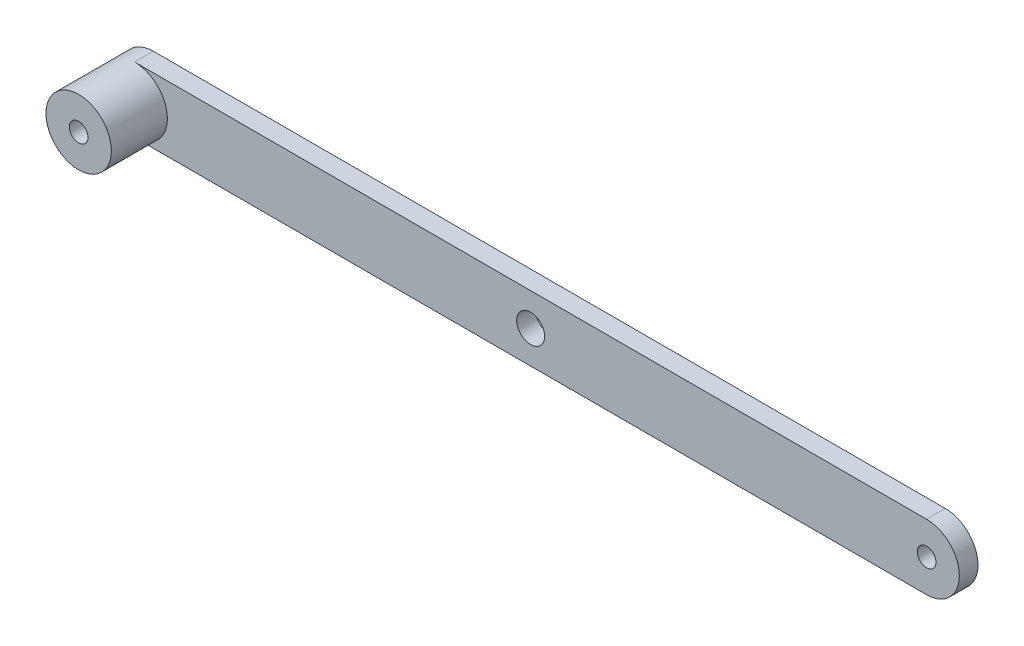
ISO-10303-21;
HEADER;
FILE_DESCRIPTION(('STEP AP214'),'2;1');
FILE_NAME('part.step','',(''),(''),'','','');
FILE_SCHEMA(('AUTOMOTIVE_DESIGN { 1 0 10303 214 1 1 1 1 }'));
ENDSEC;
DATA;
#1=APPLICATION_CONTEXT('core data for automotive mechanical design processes');
#2=APPLICATION_PROTOCOL_DEFINITION('international standard','automotive_design',2000,#1);
#3=PRODUCT_CONTEXT('',#1,'mechanical');
#4=PRODUCT('Part','Part','',(#3));
#5=PRODUCT_RELATED_PRODUCT_CATEGORY('part','',(#4));
#6=PRODUCT_DEFINITION_FORMATION('','',#4);
#7=PRODUCT_DEFINITION_CONTEXT('part definition',#1,'design');
#8=PRODUCT_DEFINITION('design','',#6,#7);
#9=PRODUCT_DEFINITION_SHAPE('','',#8);
#10=(LENGTH_UNIT() NAMED_UNIT(*) SI_UNIT(.MILLI.,.METRE.));
#11=(NAMED_UNIT(*) PLANE_ANGLE_UNIT() SI_UNIT($,.RADIAN.));
#12=(NAMED_UNIT(*) SI_UNIT($,.STERADIAN.) SOLID_ANGLE_UNIT());
#13=UNCERTAINTY_MEASURE_WITH_UNIT(LENGTH_MEASURE(1.E-05),#10,'distance_accuracy_value','');
#14=(GEOMETRIC_REPRESENTATION_CONTEXT(3) GLOBAL_UNCERTAINTY_ASSIGNED_CONTEXT((#13)) GLOBAL_UNIT_ASSIGNED_CONTEXT((#10,
#11,#12)) REPRESENTATION_CONTEXT('',''));
#15=CARTESIAN_POINT('',(0.,0.,0.));
#16=DIRECTION('',(0.,0.,1.));
#17=DIRECTION('',(1.,0.,0.));
#18=AXIS2_PLACEMENT_3D('',#15,#16,#17);
#19=CARTESIAN_POINT('',(-212.,0.,10.));
#20=DIRECTION('',(0.,0.,1.));
#21=DIRECTION('',(1.,0.,0.));
#22=AXIS2_PLACEMENT_3D('',#19,#20,#21);
#23=PLANE('',#22);
#24=CARTESIAN_POINT('',(-212.,0.,10.));
#25=DIRECTION('',(0.,0.,1.));
#26=DIRECTION('',(1.,0.,0.));
#27=AXIS2_PLACEMENT_3D('',#24,#25,#26);
#28=CIRCLE('',#27,17.5);
#29=CARTESIAN_POINT('',(-212.,-17.5,10.));
#30=VERTEX_POINT('',#29);
#31=CARTESIAN_POINT('',(-212.,17.5,10.));
#32=VERTEX_POINT('',#31);
#33=EDGE_CURVE('E11',#30,#32,#28,.T.);
#34=ORIENTED_EDGE('',*,*,#33,.F.);
#35=DIRECTION('',(1.,0.,0.));
#36=VECTOR('',#35,1.);
#37=CARTESIAN_POINT('',(-212.,-17.5,10.));
#38=LINE('',#37,#36);
#39=CARTESIAN_POINT('',(212.,-17.5,10.));
#40=VERTEX_POINT('',#39);
#41=EDGE_CURVE('E113',#30,#40,#38,.T.);
#42=ORIENTED_EDGE('',*,*,#41,.T.);
#43=CARTESIAN_POINT('',(212.,0.,10.));
#44=DIRECTION('',(0.,0.,1.));
#45=DIRECTION('',(1.,0.,0.));
#46=AXIS2_PLACEMENT_3D('',#43,#44,#45);
#47=CIRCLE('',#46,17.5);
#48=CARTESIAN_POINT('',(212.,17.5,10.));
#49=VERTEX_POINT('',#48);
#50=EDGE_CURVE('E58',#40,#49,#47,.T.);
#51=ORIENTED_EDGE('',*,*,#50,.T.);
#52=DIRECTION('',(-1.,0.,0.));
#53=VECTOR('',#52,1.);
#54=CARTESIAN_POINT('',(-212.,17.5,10.));
#55=LINE('',#54,#53);
#56=EDGE_CURVE('E89',#49,#32,#55,.T.);
#57=ORIENTED_EDGE('',*,*,#56,.T.);
#58=EDGE_LOOP('',(#34,#42,#51,#57));
#59=FACE_BOUND('',#58,.T.);
#60=CARTESIAN_POINT('',(212.,0.,10.));
#61=DIRECTION('',(0.,0.,1.));
#62=DIRECTION('',(1.,0.,0.));
#63=AXIS2_PLACEMENT_3D('',#60,#61,#62);
#64=CIRCLE('',#63,5.00000000000002);
#65=CARTESIAN_POINT('',(217.,0.,10.));
#66=VERTEX_POINT('',#65);
#67=EDGE_CURVE('E129',#66,#66,#64,.T.);
#68=ORIENTED_EDGE('',*,*,#67,.F.);
#69=EDGE_LOOP('',(#68));
#70=FACE_BOUND('',#69,.T.);
#71=CARTESIAN_POINT('',(0.,0.,10.));
#72=DIRECTION('',(0.,0.,1.));
#73=DIRECTION('',(1.,0.,0.));
#74=AXIS2_PLACEMENT_3D('',#71,#72,#73);
#75=CIRCLE('',#74,7.5);
#76=CARTESIAN_POINT('',(7.5,0.,10.));
#77=VERTEX_POINT('',#76);
#78=EDGE_CURVE('E134',#77,#77,#75,.T.);
#79=ORIENTED_EDGE('',*,*,#78,.F.);
#80=EDGE_LOOP('',(#79));
#81=FACE_BOUND('',#80,.T.);
#82=ADVANCED_FACE('F39',(#59,#70,#81),#23,.T.);
#83=CARTESIAN_POINT('',(-212.,0.,0.));
#84=DIRECTION('',(0.,0.,1.));
#85=DIRECTION('',(1.,0.,0.));
#86=AXIS2_PLACEMENT_3D('',#83,#84,#85);
#87=PLANE('',#86);
#88=CARTESIAN_POINT('',(-212.,0.,0.));
#89=DIRECTION('',(0.,0.,1.));
#90=DIRECTION('',(1.,0.,0.));
#91=AXIS2_PLACEMENT_3D('',#88,#89,#90);
#92=CIRCLE('',#91,17.5);
#93=CARTESIAN_POINT('',(-212.,17.5,0.));
#94=VERTEX_POINT('',#93);
#95=CARTESIAN_POINT('',(-212.,-17.5,0.));
#96=VERTEX_POINT('',#95);
#97=EDGE_CURVE('E102',#94,#96,#92,.T.);
#98=ORIENTED_EDGE('',*,*,#97,.F.);
#99=DIRECTION('',(-1.,0.,0.));
#100=VECTOR('',#99,1.);
#101=CARTESIAN_POINT('',(-212.,17.5,0.));
#102=LINE('',#101,#100);
#103=CARTESIAN_POINT('',(212.,17.5,0.));
#104=VERTEX_POINT('',#103);
#105=EDGE_CURVE('E81',#104,#94,#102,.T.);
#106=ORIENTED_EDGE('',*,*,#105,.F.);
#107=CARTESIAN_POINT('',(212.,0.,0.));
#108=DIRECTION('',(0.,0.,1.));
#109=DIRECTION('',(1.,0.,0.));
#110=AXIS2_PLACEMENT_3D('',#107,#108,#109);
#111=CIRCLE('',#110,17.5);
#112=CARTESIAN_POINT('',(212.,-17.5,0.));
#113=VERTEX_POINT('',#112);
#114=EDGE_CURVE('E75',#113,#104,#111,.T.);
#115=ORIENTED_EDGE('',*,*,#114,.F.);
#116=DIRECTION('',(1.,0.,0.));
#117=VECTOR('',#116,1.);
#118=CARTESIAN_POINT('',(-212.,-17.5,0.));
#119=LINE('',#118,#117);
#120=EDGE_CURVE('E116',#96,#113,#119,.T.);
#121=ORIENTED_EDGE('',*,*,#120,.F.);
#122=EDGE_LOOP('',(#98,#106,#115,#121));
#123=FACE_BOUND('',#122,.T.);
#124=CARTESIAN_POINT('',(-212.,0.,0.));
#125=DIRECTION('',(0.,0.,1.));
#126=DIRECTION('',(1.,0.,0.));
#127=AXIS2_PLACEMENT_3D('',#124,#125,#126);
#128=CIRCLE('',#127,5.00000000000002);
#129=CARTESIAN_POINT('',(-207.,0.,0.));
#130=VERTEX_POINT('',#129);
#131=EDGE_CURVE('E120',#130,#130,#128,.T.);
#132=ORIENTED_EDGE('',*,*,#131,.T.);
#133=EDGE_LOOP('',(#132));
#134=FACE_BOUND('',#133,.T.);
#135=CARTESIAN_POINT('',(212.,0.,0.));
#136=DIRECTION('',(0.,0.,1.));
#137=DIRECTION('',(1.,0.,0.));
#138=AXIS2_PLACEMENT_3D('',#135,#136,#137);
#139=CIRCLE('',#138,5.00000000000002);
#140=CARTESIAN_POINT('',(217.,0.,0.));
#141=VERTEX_POINT('',#140);
#142=EDGE_CURVE('E130',#141,#141,#139,.T.);
#143=ORIENTED_EDGE('',*,*,#142,.T.);
#144=EDGE_LOOP('',(#143));
#145=FACE_BOUND('',#144,.T.);
#146=CARTESIAN_POINT('',(0.,0.,0.));
#147=DIRECTION('',(0.,0.,1.));
#148=DIRECTION('',(1.,0.,0.));
#149=AXIS2_PLACEMENT_3D('',#146,#147,#148);
#150=CIRCLE('',#149,7.5);
#151=CARTESIAN_POINT('',(7.5,0.,0.));
#152=VERTEX_POINT('',#151);
#153=EDGE_CURVE('E138',#152,#152,#150,.T.);
#154=ORIENTED_EDGE('',*,*,#153,.T.);
#155=EDGE_LOOP('',(#154));
#156=FACE_BOUND('',#155,.T.);
#157=ADVANCED_FACE('F168',(#123,#134,#145,#156),#87,.F.);
#158=CARTESIAN_POINT('',(-212.,0.,10.));
#159=DIRECTION('',(0.,0.,-1.));
#160=DIRECTION('',(-1.,0.,0.));
#161=AXIS2_PLACEMENT_3D('',#158,#159,#160);
#162=CYLINDRICAL_SURFACE('',#161,17.5);
#163=ORIENTED_EDGE('',*,*,#97,.T.);
#164=DIRECTION('',(0.,0.,-1.));
#165=VECTOR('',#164,1.);
#166=CARTESIAN_POINT('',(-212.,-17.5,10.));
#167=LINE('',#166,#165);
#168=EDGE_CURVE('E43',#30,#96,#167,.T.);
#169=ORIENTED_EDGE('',*,*,#168,.F.);
#170=ORIENTED_EDGE('',*,*,#33,.T.);
#171=DIRECTION('',(0.,0.,-1.));
#172=VECTOR('',#171,1.);
#173=CARTESIAN_POINT('',(-212.,17.5,10.));
#174=LINE('',#173,#172);
#175=EDGE_CURVE('E87',#32,#94,#174,.T.);
#176=ORIENTED_EDGE('',*,*,#175,.T.);
#177=EDGE_LOOP('',(#163,#169,#170,#176));
#178=FACE_BOUND('',#177,.T.);
#179=CARTESIAN_POINT('',(-212.,0.,40.));
#180=DIRECTION('',(0.,0.,1.));
#181=DIRECTION('',(1.,0.,0.));
#182=AXIS2_PLACEMENT_3D('',#179,#180,#181);
#183=CIRCLE('',#182,17.5);
#184=CARTESIAN_POINT('',(-194.5,0.,40.));
#185=VERTEX_POINT('',#184);
#186=EDGE_CURVE('E142',#185,#185,#183,.T.);
#187=ORIENTED_EDGE('',*,*,#186,.F.);
#188=EDGE_LOOP('',(#187));
#189=FACE_BOUND('',#188,.T.);
#190=ADVANCED_FACE('F41',(#178,#189),#162,.T.);
#191=CARTESIAN_POINT('',(-212.,-17.5,10.));
#192=DIRECTION('',(0.,1.,0.));
#193=DIRECTION('',(0.,0.,1.));
#194=AXIS2_PLACEMENT_3D('',#191,#192,#193);
#195=PLANE('',#194);
#196=ORIENTED_EDGE('',*,*,#120,.T.);
#197=DIRECTION('',(0.,0.,-1.));
#198=VECTOR('',#197,1.);
#199=CARTESIAN_POINT('',(212.,-17.5,10.));
#200=LINE('',#199,#198);
#201=EDGE_CURVE('E105',#40,#113,#200,.T.);
#202=ORIENTED_EDGE('',*,*,#201,.F.);
#203=ORIENTED_EDGE('',*,*,#41,.F.);
#204=ORIENTED_EDGE('',*,*,#168,.T.);
#205=EDGE_LOOP('',(#196,#202,#203,#204));
#206=FACE_BOUND('',#205,.T.);
#207=ADVANCED_FACE('F182',(#206),#195,.F.);
#208=CARTESIAN_POINT('',(212.,0.,10.));
#209=DIRECTION('',(0.,0.,-1.));
#210=DIRECTION('',(-1.,0.,0.));
#211=AXIS2_PLACEMENT_3D('',#208,#209,#210);
#212=CYLINDRICAL_SURFACE('',#211,17.5);
#213=ORIENTED_EDGE('',*,*,#114,.T.);
#214=DIRECTION('',(0.,0.,-1.));
#215=VECTOR('',#214,1.);
#216=CARTESIAN_POINT('',(212.,17.5,10.));
#217=LINE('',#216,#215);
#218=EDGE_CURVE('E94',#49,#104,#217,.T.);
#219=ORIENTED_EDGE('',*,*,#218,.F.);
#220=ORIENTED_EDGE('',*,*,#50,.F.);
#221=ORIENTED_EDGE('',*,*,#201,.T.);
#222=EDGE_LOOP('',(#213,#219,#220,#221));
#223=FACE_BOUND('',#222,.T.);
#224=ADVANCED_FACE('F180',(#223),#212,.T.);
#225=CARTESIAN_POINT('',(-212.,17.5,10.));
#226=DIRECTION('',(0.,-1.,0.));
#227=DIRECTION('',(0.,0.,-1.));
#228=AXIS2_PLACEMENT_3D('',#225,#226,#227);
#229=PLANE('',#228);
#230=ORIENTED_EDGE('',*,*,#105,.T.);
#231=ORIENTED_EDGE('',*,*,#175,.F.);
#232=ORIENTED_EDGE('',*,*,#56,.F.);
#233=ORIENTED_EDGE('',*,*,#218,.T.);
#234=EDGE_LOOP('',(#230,#231,#232,#233));
#235=FACE_BOUND('',#234,.T.);
#236=ADVANCED_FACE('F88',(#235),#229,.F.);
#237=CARTESIAN_POINT('',(-212.,0.,10.));
#238=DIRECTION('',(0.,0.,-1.));
#239=DIRECTION('',(-1.,0.,0.));
#240=AXIS2_PLACEMENT_3D('',#237,#238,#239);
#241=CYLINDRICAL_SURFACE('',#240,5.00000000000002);
#242=ORIENTED_EDGE('',*,*,#131,.F.);
#243=EDGE_LOOP('',(#242));
#244=FACE_BOUND('',#243,.T.);
#245=CARTESIAN_POINT('',(-212.,0.,40.));
#246=DIRECTION('',(0.,0.,1.));
#247=DIRECTION('',(1.,0.,0.));
#248=AXIS2_PLACEMENT_3D('',#245,#246,#247);
#249=CIRCLE('',#248,5.00000000000002);
#250=CARTESIAN_POINT('',(-207.,0.,40.));
#251=VERTEX_POINT('',#250);
#252=EDGE_CURVE('E149',#251,#251,#249,.T.);
#253=ORIENTED_EDGE('',*,*,#252,.T.);
#254=EDGE_LOOP('',(#253));
#255=FACE_BOUND('',#254,.T.);
#256=ADVANCED_FACE('F154',(#244,#255),#241,.F.);
#257=CARTESIAN_POINT('',(212.,0.,10.));
#258=DIRECTION('',(0.,0.,-1.));
#259=DIRECTION('',(-1.,0.,0.));
#260=AXIS2_PLACEMENT_3D('',#257,#258,#259);
#261=CYLINDRICAL_SURFACE('',#260,5.00000000000002);
#262=ORIENTED_EDGE('',*,*,#67,.T.);
#263=EDGE_LOOP('',(#262));
#264=FACE_BOUND('',#263,.T.);
#265=ORIENTED_EDGE('',*,*,#142,.F.);
#266=EDGE_LOOP('',(#265));
#267=FACE_BOUND('',#266,.T.);
#268=ADVANCED_FACE('F164',(#264,#267),#261,.F.);
#269=CARTESIAN_POINT('',(0.,0.,10.));
#270=DIRECTION('',(0.,0.,-1.));
#271=DIRECTION('',(-1.,0.,0.));
#272=AXIS2_PLACEMENT_3D('',#269,#270,#271);
#273=CYLINDRICAL_SURFACE('',#272,7.5);
#274=ORIENTED_EDGE('',*,*,#78,.T.);
#275=EDGE_LOOP('',(#274));
#276=FACE_BOUND('',#275,.T.);
#277=ORIENTED_EDGE('',*,*,#153,.F.);
#278=EDGE_LOOP('',(#277));
#279=FACE_BOUND('',#278,.T.);
#280=ADVANCED_FACE('F158',(#276,#279),#273,.F.);
#281=CARTESIAN_POINT('',(-212.,0.,40.));
#282=DIRECTION('',(0.,0.,1.));
#283=DIRECTION('',(1.,0.,0.));
#284=AXIS2_PLACEMENT_3D('',#281,#282,#283);
#285=PLANE('',#284);
#286=ORIENTED_EDGE('',*,*,#186,.T.);
#287=EDGE_LOOP('',(#286));
#288=FACE_BOUND('',#287,.T.);
#289=ORIENTED_EDGE('',*,*,#252,.F.);
#290=EDGE_LOOP('',(#289));
#291=FACE_BOUND('',#290,.T.);
#292=ADVANCED_FACE('F156',(#288,#291),#285,.T.);
#293=CLOSED_SHELL('',(#82,#157,#190,#207,#224,#236,#256,#268,#280,#292));
#294=MANIFOLD_SOLID_BREP('B2',#293);
#295=ADVANCED_BREP_SHAPE_REPRESENTATION('',(#18,#294),#14);
#296=SHAPE_DEFINITION_REPRESENTATION(#9,#295);
ENDSEC;
END-ISO-10303-21;
